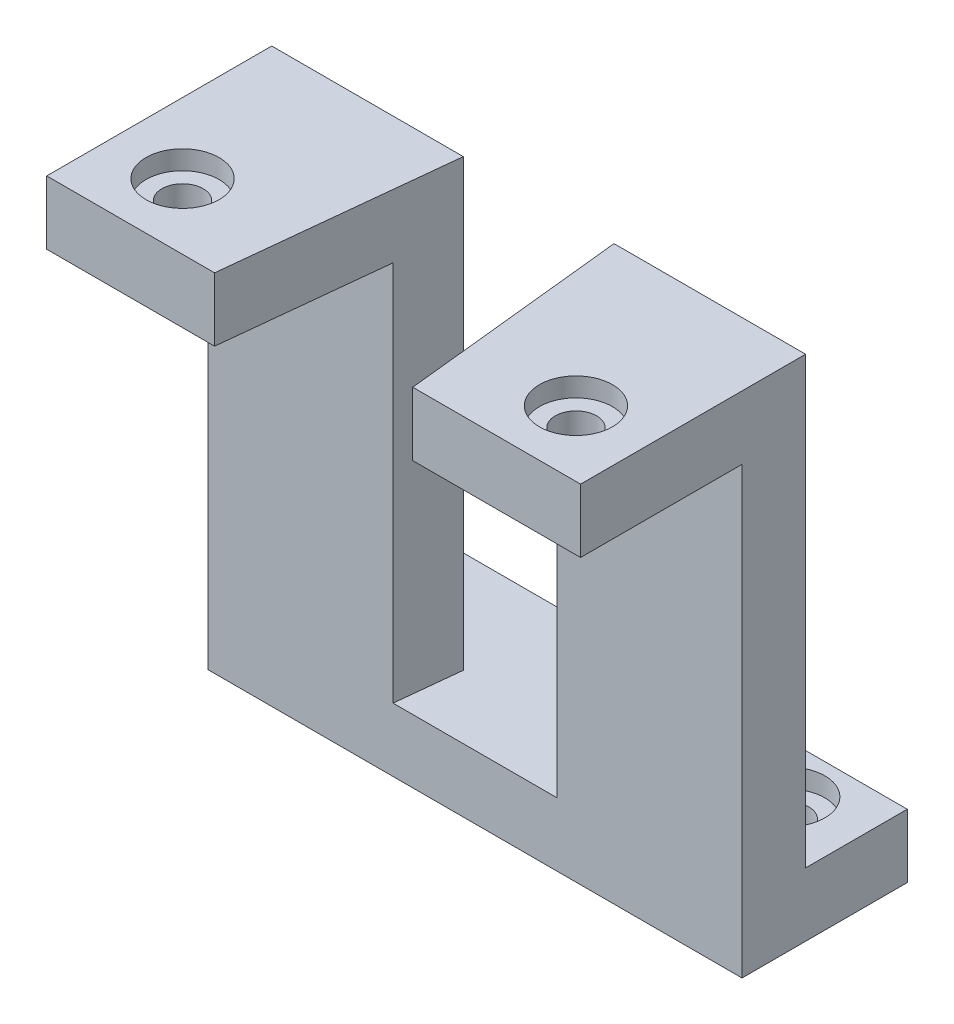
ISO-10303-21;
HEADER;
FILE_DESCRIPTION(('STEP AP214'),'2;1');
FILE_NAME('part.step','',(''),(''),'','','');
FILE_SCHEMA(('AUTOMOTIVE_DESIGN { 1 0 10303 214 1 1 1 1 }'));
ENDSEC;
DATA;
#1=APPLICATION_CONTEXT('core data for automotive mechanical design processes');
#2=APPLICATION_PROTOCOL_DEFINITION('international standard','automotive_design',2000,#1);
#3=PRODUCT_CONTEXT('',#1,'mechanical');
#4=PRODUCT('Part','Part','',(#3));
#5=PRODUCT_RELATED_PRODUCT_CATEGORY('part','',(#4));
#6=PRODUCT_DEFINITION_FORMATION('','',#4);
#7=PRODUCT_DEFINITION_CONTEXT('part definition',#1,'design');
#8=PRODUCT_DEFINITION('design','',#6,#7);
#9=PRODUCT_DEFINITION_SHAPE('','',#8);
#10=(LENGTH_UNIT() NAMED_UNIT(*) SI_UNIT(.MILLI.,.METRE.));
#11=(NAMED_UNIT(*) PLANE_ANGLE_UNIT() SI_UNIT($,.RADIAN.));
#12=(NAMED_UNIT(*) SI_UNIT($,.STERADIAN.) SOLID_ANGLE_UNIT());
#13=UNCERTAINTY_MEASURE_WITH_UNIT(LENGTH_MEASURE(1.E-05),#10,'distance_accuracy_value','');
#14=(GEOMETRIC_REPRESENTATION_CONTEXT(3) GLOBAL_UNCERTAINTY_ASSIGNED_CONTEXT((#13)) GLOBAL_UNIT_ASSIGNED_CONTEXT((#10,
#11,#12)) REPRESENTATION_CONTEXT('',''));
#15=CARTESIAN_POINT('',(0.,0.,0.));
#16=DIRECTION('',(0.,0.,1.));
#17=DIRECTION('',(1.,0.,0.));
#18=AXIS2_PLACEMENT_3D('',#15,#16,#17);
#19=CARTESIAN_POINT('',(-21.,10.,-12.7244387232156));
#20=DIRECTION('',(0.,0.,1.));
#21=DIRECTION('',(1.,0.,0.));
#22=AXIS2_PLACEMENT_3D('',#19,#20,#21);
#23=PLANE('',#22);
#24=DIRECTION('',(1.,0.,0.));
#25=VECTOR('',#24,1.);
#26=CARTESIAN_POINT('',(21.,-25.,-12.7244387232156));
#27=LINE('',#26,#25);
#28=CARTESIAN_POINT('',(5.92793817651512,-25.,-12.7244387232156));
#29=VERTEX_POINT('',#28);
#30=CARTESIAN_POINT('',(21.,-25.,-12.7244387232156));
#31=VERTEX_POINT('',#30);
#32=EDGE_CURVE('E153',#29,#31,#27,.T.);
#33=ORIENTED_EDGE('',*,*,#32,.F.);
#34=DIRECTION('',(0.,1.,0.));
#35=VECTOR('',#34,1.);
#36=CARTESIAN_POINT('',(5.92793817651512,-48.5884902828483,-12.7244387232156));
#37=LINE('',#36,#35);
#38=CARTESIAN_POINT('',(5.92793817651512,10.,-12.7244387232156));
#39=VERTEX_POINT('',#38);
#40=EDGE_CURVE('E159',#29,#39,#37,.T.);
#41=ORIENTED_EDGE('',*,*,#40,.T.);
#42=DIRECTION('',(-1.,0.,0.));
#43=VECTOR('',#42,1.);
#44=CARTESIAN_POINT('',(-21.,10.,-12.7244387232156));
#45=LINE('',#44,#43);
#46=CARTESIAN_POINT('',(21.,10.,-12.7244387232156));
#47=VERTEX_POINT('',#46);
#48=EDGE_CURVE('E233',#47,#39,#45,.T.);
#49=ORIENTED_EDGE('',*,*,#48,.F.);
#50=DIRECTION('',(0.,-1.,0.));
#51=VECTOR('',#50,1.);
#52=CARTESIAN_POINT('',(21.,10.,-12.7244387232156));
#53=LINE('',#52,#51);
#54=EDGE_CURVE('E173',#47,#31,#53,.T.);
#55=ORIENTED_EDGE('',*,*,#54,.T.);
#56=EDGE_LOOP('',(#33,#41,#49,#55));
#57=FACE_BOUND('',#56,.T.);
#58=ADVANCED_FACE('F45',(#57),#23,.F.);
#59=CARTESIAN_POINT('',(0.,10.,0.));
#60=DIRECTION('',(0.,1.,0.));
#61=DIRECTION('',(0.,0.,1.));
#62=AXIS2_PLACEMENT_3D('',#59,#60,#61);
#63=PLANE('',#62);
#64=DIRECTION('',(-0.104911561400397,0.,-0.994481555527568));
#65=VECTOR('',#64,1.);
#66=CARTESIAN_POINT('',(7.79534727241365,10.,4.97717469008432));
#67=LINE('',#66,#65);
#68=CARTESIAN_POINT('',(7.79534727241365,10.,4.97717469008432));
#69=VERTEX_POINT('',#68);
#70=EDGE_CURVE('E165',#69,#39,#67,.T.);
#71=ORIENTED_EDGE('',*,*,#70,.F.);
#72=DIRECTION('',(1.,0.,0.));
#73=VECTOR('',#72,1.);
#74=CARTESIAN_POINT('',(-21.,10.,4.97717469008432));
#75=LINE('',#74,#73);
#76=CARTESIAN_POINT('',(21.,10.,4.97717469008432));
#77=VERTEX_POINT('',#76);
#78=EDGE_CURVE('E239',#69,#77,#75,.T.);
#79=ORIENTED_EDGE('',*,*,#78,.T.);
#80=DIRECTION('',(0.,0.,-1.));
#81=VECTOR('',#80,1.);
#82=CARTESIAN_POINT('',(21.,10.,-4.97717469008432));
#83=LINE('',#82,#81);
#84=EDGE_CURVE('E228',#77,#47,#83,.T.);
#85=ORIENTED_EDGE('',*,*,#84,.T.);
#86=ORIENTED_EDGE('',*,*,#48,.T.);
#87=EDGE_LOOP('',(#71,#79,#85,#86));
#88=FACE_BOUND('',#87,.T.);
#89=CARTESIAN_POINT('',(15.475,10.,-0.182409543615654));
#90=DIRECTION('',(0.,1.,0.));
#91=DIRECTION('',(0.,0.,1.));
#92=AXIS2_PLACEMENT_3D('',#89,#90,#91);
#93=CIRCLE('',#92,2.875);
#94=CARTESIAN_POINT('',(15.475,10.,2.69259045638435));
#95=VERTEX_POINT('',#94);
#96=EDGE_CURVE('E221',#95,#95,#93,.T.);
#97=ORIENTED_EDGE('',*,*,#96,.F.);
#98=EDGE_LOOP('',(#97));
#99=FACE_BOUND('',#98,.T.);
#100=ADVANCED_FACE('F335',(#88,#99),#63,.T.);
#101=CARTESIAN_POINT('',(-21.,10.,4.97717469008432));
#102=DIRECTION('',(0.,0.,-1.));
#103=DIRECTION('',(-1.,0.,0.));
#104=AXIS2_PLACEMENT_3D('',#101,#102,#103);
#105=PLANE('',#104);
#106=ORIENTED_EDGE('',*,*,#78,.F.);
#107=DIRECTION('',(0.,1.,0.));
#108=VECTOR('',#107,1.);
#109=CARTESIAN_POINT('',(7.79534727241365,-48.5884902828483,4.97717469008432));
#110=LINE('',#109,#108);
#111=CARTESIAN_POINT('',(7.79534727241365,5.,4.97717469008432));
#112=VERTEX_POINT('',#111);
#113=EDGE_CURVE('E341',#112,#69,#110,.T.);
#114=ORIENTED_EDGE('',*,*,#113,.F.);
#115=DIRECTION('',(-1.,0.,0.));
#116=VECTOR('',#115,1.);
#117=CARTESIAN_POINT('',(21.001,5.,4.97717469008432));
#118=LINE('',#117,#116);
#119=CARTESIAN_POINT('',(21.,5.,4.97717469008432));
#120=VERTEX_POINT('',#119);
#121=EDGE_CURVE('E283',#120,#112,#118,.T.);
#122=ORIENTED_EDGE('',*,*,#121,.F.);
#123=DIRECTION('',(0.,-1.,0.));
#124=VECTOR('',#123,1.);
#125=CARTESIAN_POINT('',(21.,10.,4.97717469008432));
#126=LINE('',#125,#124);
#127=EDGE_CURVE('E244',#77,#120,#126,.T.);
#128=ORIENTED_EDGE('',*,*,#127,.F.);
#129=EDGE_LOOP('',(#106,#114,#122,#128));
#130=FACE_BOUND('',#129,.T.);
#131=ADVANCED_FACE('F340',(#130),#105,.F.);
#132=CARTESIAN_POINT('',(21.001,5.,-7.7244387232156));
#133=DIRECTION('',(0.,1.,0.));
#134=DIRECTION('',(0.,0.,1.));
#135=AXIS2_PLACEMENT_3D('',#132,#133,#134);
#136=PLANE('',#135);
#137=CARTESIAN_POINT('',(15.475,5.,-0.182409543615654));
#138=DIRECTION('',(0.,1.,0.));
#139=DIRECTION('',(0.,0.,1.));
#140=AXIS2_PLACEMENT_3D('',#137,#138,#139);
#141=CIRCLE('',#140,1.625);
#142=CARTESIAN_POINT('',(15.475,5.,1.44259045638435));
#143=VERTEX_POINT('',#142);
#144=EDGE_CURVE('E298',#143,#143,#141,.F.);
#145=ORIENTED_EDGE('',*,*,#144,.F.);
#146=EDGE_LOOP('',(#145));
#147=FACE_BOUND('',#146,.T.);
#148=ORIENTED_EDGE('',*,*,#121,.T.);
#149=DIRECTION('',(-0.104911561400397,0.,-0.994481555527568));
#150=VECTOR('',#149,1.);
#151=CARTESIAN_POINT('',(6.61550192638206,5.,-6.20685897924032));
#152=LINE('',#151,#150);
#153=CARTESIAN_POINT('',(6.4554067897703,5.,-7.7244387232156));
#154=VERTEX_POINT('',#153);
#155=EDGE_CURVE('E54',#112,#154,#152,.T.);
#156=ORIENTED_EDGE('',*,*,#155,.T.);
#157=DIRECTION('',(-1.,0.,0.));
#158=VECTOR('',#157,1.);
#159=CARTESIAN_POINT('',(21.001,5.,-7.7244387232156));
#160=LINE('',#159,#158);
#161=CARTESIAN_POINT('',(21.,5.,-7.7244387232156));
#162=VERTEX_POINT('',#161);
#163=EDGE_CURVE('E176',#162,#154,#160,.T.);
#164=ORIENTED_EDGE('',*,*,#163,.F.);
#165=DIRECTION('',(0.,0.,1.));
#166=VECTOR('',#165,1.);
#167=CARTESIAN_POINT('',(21.,5.,-7.7244387232156));
#168=LINE('',#167,#166);
#169=EDGE_CURVE('E294',#162,#120,#168,.T.);
#170=ORIENTED_EDGE('',*,*,#169,.T.);
#171=EDGE_LOOP('',(#148,#156,#164,#170));
#172=FACE_BOUND('',#171,.T.);
#173=ADVANCED_FACE('F280',(#147,#172),#136,.F.);
#174=CARTESIAN_POINT('',(15.475,-30.001,-16.8849666072387));
#175=DIRECTION('',(0.,1.,0.));
#176=DIRECTION('',(-1.,0.,0.));
#177=AXIS2_PLACEMENT_3D('',#174,#175,#176);
#178=CYLINDRICAL_SURFACE('',#177,1.625);
#179=CARTESIAN_POINT('',(15.475,-30.,-16.8849666072387));
#180=DIRECTION('',(0.,1.,0.));
#181=DIRECTION('',(0.,0.,1.));
#182=AXIS2_PLACEMENT_3D('',#179,#180,#181);
#183=CIRCLE('',#182,1.625);
#184=CARTESIAN_POINT('',(15.475,-30.,-15.2599666072387));
#185=VERTEX_POINT('',#184);
#186=EDGE_CURVE('E273',#185,#185,#183,.F.);
#187=ORIENTED_EDGE('',*,*,#186,.T.);
#188=EDGE_LOOP('',(#187));
#189=FACE_BOUND('',#188,.T.);
#190=CARTESIAN_POINT('',(15.475,-26.5,-16.8849666072387));
#191=DIRECTION('',(0.,1.,0.));
#192=DIRECTION('',(-1.,0.,0.));
#193=AXIS2_PLACEMENT_3D('',#190,#191,#192);
#194=CIRCLE('',#193,1.625);
#195=CARTESIAN_POINT('',(13.85,-26.5,-16.8849666072387));
#196=VERTEX_POINT('',#195);
#197=EDGE_CURVE('E268',#196,#196,#194,.F.);
#198=ORIENTED_EDGE('',*,*,#197,.F.);
#199=EDGE_LOOP('',(#198));
#200=FACE_BOUND('',#199,.T.);
#201=ADVANCED_FACE('F415',(#189,#200),#178,.F.);
#202=CARTESIAN_POINT('',(-15.475,-30.001,-16.8849666072387));
#203=DIRECTION('',(0.,1.,0.));
#204=DIRECTION('',(-1.,0.,0.));
#205=AXIS2_PLACEMENT_3D('',#202,#203,#204);
#206=CYLINDRICAL_SURFACE('',#205,1.625);
#207=CARTESIAN_POINT('',(-15.475,-30.,-16.8849666072387));
#208=DIRECTION('',(0.,1.,0.));
#209=DIRECTION('',(0.,0.,1.));
#210=AXIS2_PLACEMENT_3D('',#207,#208,#209);
#211=CIRCLE('',#210,1.625);
#212=CARTESIAN_POINT('',(-15.475,-30.,-15.2599666072387));
#213=VERTEX_POINT('',#212);
#214=EDGE_CURVE('E299',#213,#213,#211,.F.);
#215=ORIENTED_EDGE('',*,*,#214,.T.);
#216=EDGE_LOOP('',(#215));
#217=FACE_BOUND('',#216,.T.);
#218=CARTESIAN_POINT('',(-15.475,-26.5,-16.8849666072387));
#219=DIRECTION('',(0.,1.,0.));
#220=DIRECTION('',(-1.,0.,0.));
#221=AXIS2_PLACEMENT_3D('',#218,#219,#220);
#222=CIRCLE('',#221,1.625);
#223=CARTESIAN_POINT('',(-17.1,-26.5,-16.8849666072387));
#224=VERTEX_POINT('',#223);
#225=EDGE_CURVE('E264',#224,#224,#222,.F.);
#226=ORIENTED_EDGE('',*,*,#225,.F.);
#227=EDGE_LOOP('',(#226));
#228=FACE_BOUND('',#227,.T.);
#229=ADVANCED_FACE('F405',(#217,#228),#206,.F.);
#230=CARTESIAN_POINT('',(-5.92793817651512,10.,-12.7244387232156));
#231=VERTEX_POINT('',#230);
#232=CARTESIAN_POINT('',(-21.,10.,-12.7244387232156));
#233=VERTEX_POINT('',#232);
#234=EDGE_CURVE('E231',#231,#233,#45,.T.);
#235=ORIENTED_EDGE('',*,*,#234,.F.);
#236=DIRECTION('',(0.,1.,0.));
#237=VECTOR('',#236,1.);
#238=CARTESIAN_POINT('',(-5.92793817651512,-48.5884902828483,-12.7244387232156));
#239=LINE('',#238,#237);
#240=CARTESIAN_POINT('',(-5.92793817651512,-25.,-12.7244387232156));
#241=VERTEX_POINT('',#240);
#242=EDGE_CURVE('E170',#241,#231,#239,.T.);
#243=ORIENTED_EDGE('',*,*,#242,.F.);
#244=CARTESIAN_POINT('',(-21.,-25.,-12.7244387232156));
#245=VERTEX_POINT('',#244);
#246=EDGE_CURVE('E69',#245,#241,#27,.T.);
#247=ORIENTED_EDGE('',*,*,#246,.F.);
#248=DIRECTION('',(0.,-1.,0.));
#249=VECTOR('',#248,1.);
#250=CARTESIAN_POINT('',(-21.,10.,-12.7244387232156));
#251=LINE('',#250,#249);
#252=EDGE_CURVE('E252',#233,#245,#251,.T.);
#253=ORIENTED_EDGE('',*,*,#252,.F.);
#254=EDGE_LOOP('',(#235,#243,#247,#253));
#255=FACE_BOUND('',#254,.T.);
#256=ADVANCED_FACE('F396',(#255),#23,.F.);
#257=CARTESIAN_POINT('',(-15.475,10.,-0.182409543615654));
#258=DIRECTION('',(0.,-1.,0.));
#259=DIRECTION('',(0.,0.,-1.));
#260=AXIS2_PLACEMENT_3D('',#257,#258,#259);
#261=CYLINDRICAL_SURFACE('',#260,1.625);
#262=CARTESIAN_POINT('',(-15.475,5.,-0.182409543615654));
#263=DIRECTION('',(0.,1.,0.));
#264=DIRECTION('',(0.,0.,1.));
#265=AXIS2_PLACEMENT_3D('',#262,#263,#264);
#266=CIRCLE('',#265,1.625);
#267=CARTESIAN_POINT('',(-15.475,5.,1.44259045638435));
#268=VERTEX_POINT('',#267);
#269=EDGE_CURVE('E304',#268,#268,#266,.F.);
#270=ORIENTED_EDGE('',*,*,#269,.T.);
#271=EDGE_LOOP('',(#270));
#272=FACE_BOUND('',#271,.T.);
#273=CARTESIAN_POINT('',(-15.475,8.5,-0.182409543615654));
#274=DIRECTION('',(0.,1.,0.));
#275=DIRECTION('',(0.,0.,1.));
#276=AXIS2_PLACEMENT_3D('',#273,#274,#275);
#277=CIRCLE('',#276,1.625);
#278=CARTESIAN_POINT('',(-15.475,8.5,1.44259045638435));
#279=VERTEX_POINT('',#278);
#280=EDGE_CURVE('E232',#279,#279,#277,.T.);
#281=ORIENTED_EDGE('',*,*,#280,.T.);
#282=EDGE_LOOP('',(#281));
#283=FACE_BOUND('',#282,.T.);
#284=ADVANCED_FACE('F404',(#272,#283),#261,.F.);
#285=CARTESIAN_POINT('',(15.475,10.,-0.182409543615654));
#286=DIRECTION('',(0.,-1.,0.));
#287=DIRECTION('',(0.,0.,-1.));
#288=AXIS2_PLACEMENT_3D('',#285,#286,#287);
#289=CYLINDRICAL_SURFACE('',#288,1.625);
#290=ORIENTED_EDGE('',*,*,#144,.T.);
#291=EDGE_LOOP('',(#290));
#292=FACE_BOUND('',#291,.T.);
#293=CARTESIAN_POINT('',(15.475,8.5,-0.182409543615654));
#294=DIRECTION('',(0.,1.,0.));
#295=DIRECTION('',(0.,0.,1.));
#296=AXIS2_PLACEMENT_3D('',#293,#294,#295);
#297=CIRCLE('',#296,1.625);
#298=CARTESIAN_POINT('',(15.475,8.5,1.44259045638435));
#299=VERTEX_POINT('',#298);
#300=EDGE_CURVE('E216',#299,#299,#297,.T.);
#301=ORIENTED_EDGE('',*,*,#300,.T.);
#302=EDGE_LOOP('',(#301));
#303=FACE_BOUND('',#302,.T.);
#304=ADVANCED_FACE('F411',(#292,#303),#289,.F.);
#305=DIRECTION('',(-0.104911561400397,0.,0.994481555527568));
#306=VECTOR('',#305,1.);
#307=CARTESIAN_POINT('',(-7.79534727241365,10.,4.97717469008432));
#308=LINE('',#307,#306);
#309=CARTESIAN_POINT('',(-7.79534727241365,10.,4.97717469008432));
#310=VERTEX_POINT('',#309);
#311=EDGE_CURVE('E160',#231,#310,#308,.T.);
#312=ORIENTED_EDGE('',*,*,#311,.F.);
#313=ORIENTED_EDGE('',*,*,#234,.T.);
#314=DIRECTION('',(0.,0.,1.));
#315=VECTOR('',#314,1.);
#316=CARTESIAN_POINT('',(-21.,10.,-4.97717469008432));
#317=LINE('',#316,#315);
#318=CARTESIAN_POINT('',(-21.,10.,4.97717469008432));
#319=VERTEX_POINT('',#318);
#320=EDGE_CURVE('E236',#233,#319,#317,.T.);
#321=ORIENTED_EDGE('',*,*,#320,.T.);
#322=EDGE_CURVE('E240',#319,#310,#75,.T.);
#323=ORIENTED_EDGE('',*,*,#322,.T.);
#324=EDGE_LOOP('',(#312,#313,#321,#323));
#325=FACE_BOUND('',#324,.T.);
#326=CARTESIAN_POINT('',(-15.475,10.,-0.182409543615654));
#327=DIRECTION('',(0.,1.,0.));
#328=DIRECTION('',(0.,0.,1.));
#329=AXIS2_PLACEMENT_3D('',#326,#327,#328);
#330=CIRCLE('',#329,2.875);
#331=CARTESIAN_POINT('',(-15.475,10.,2.69259045638435));
#332=VERTEX_POINT('',#331);
#333=EDGE_CURVE('E217',#332,#332,#330,.T.);
#334=ORIENTED_EDGE('',*,*,#333,.F.);
#335=EDGE_LOOP('',(#334));
#336=FACE_BOUND('',#335,.T.);
#337=ADVANCED_FACE('F401',(#325,#336),#63,.T.);
#338=CARTESIAN_POINT('',(21.,10.,-12.7244387232156));
#339=DIRECTION('',(-1.,0.,0.));
#340=DIRECTION('',(0.,0.,1.));
#341=AXIS2_PLACEMENT_3D('',#338,#339,#340);
#342=PLANE('',#341);
#343=ORIENTED_EDGE('',*,*,#169,.F.);
#344=DIRECTION('',(0.,1.,0.));
#345=VECTOR('',#344,1.);
#346=CARTESIAN_POINT('',(21.,-30.,-7.7244387232156));
#347=LINE('',#346,#345);
#348=CARTESIAN_POINT('',(21.,-30.,-7.7244387232156));
#349=VERTEX_POINT('',#348);
#350=EDGE_CURVE('E208',#349,#162,#347,.T.);
#351=ORIENTED_EDGE('',*,*,#350,.F.);
#352=DIRECTION('',(0.,0.,1.));
#353=VECTOR('',#352,1.);
#354=CARTESIAN_POINT('',(21.,-30.,-12.7244387232156));
#355=LINE('',#354,#353);
#356=CARTESIAN_POINT('',(21.,-30.,-20.7244387232156));
#357=VERTEX_POINT('',#356);
#358=EDGE_CURVE('E198',#357,#349,#355,.T.);
#359=ORIENTED_EDGE('',*,*,#358,.F.);
#360=DIRECTION('',(0.,-1.,0.));
#361=VECTOR('',#360,1.);
#362=CARTESIAN_POINT('',(21.,-30.,-20.7244387232156));
#363=LINE('',#362,#361);
#364=CARTESIAN_POINT('',(21.,-25.,-20.7244387232156));
#365=VERTEX_POINT('',#364);
#366=EDGE_CURVE('E180',#365,#357,#363,.T.);
#367=ORIENTED_EDGE('',*,*,#366,.F.);
#368=DIRECTION('',(0.,0.,1.));
#369=VECTOR('',#368,1.);
#370=CARTESIAN_POINT('',(21.,-25.,-20.7244387232156));
#371=LINE('',#370,#369);
#372=EDGE_CURVE('E188',#365,#31,#371,.T.);
#373=ORIENTED_EDGE('',*,*,#372,.T.);
#374=ORIENTED_EDGE('',*,*,#54,.F.);
#375=ORIENTED_EDGE('',*,*,#84,.F.);
#376=ORIENTED_EDGE('',*,*,#127,.T.);
#377=EDGE_LOOP('',(#343,#351,#359,#367,#373,#374,#375,#376));
#378=FACE_BOUND('',#377,.T.);
#379=ADVANCED_FACE('F47',(#378),#342,.F.);
#380=CARTESIAN_POINT('',(-21.,10.,-4.97717469008432));
#381=DIRECTION('',(1.,0.,0.));
#382=DIRECTION('',(0.,0.,-1.));
#383=AXIS2_PLACEMENT_3D('',#380,#381,#382);
#384=PLANE('',#383);
#385=DIRECTION('',(0.,1.,0.));
#386=VECTOR('',#385,1.);
#387=CARTESIAN_POINT('',(-21.,-30.,-7.7244387232156));
#388=LINE('',#387,#386);
#389=CARTESIAN_POINT('',(-21.,-30.,-7.7244387232156));
#390=VERTEX_POINT('',#389);
#391=CARTESIAN_POINT('',(-21.,5.,-7.7244387232156));
#392=VERTEX_POINT('',#391);
#393=EDGE_CURVE('E204',#390,#392,#388,.T.);
#394=ORIENTED_EDGE('',*,*,#393,.T.);
#395=DIRECTION('',(0.,0.,-1.));
#396=VECTOR('',#395,1.);
#397=CARTESIAN_POINT('',(-21.,5.,-7.7244387232156));
#398=LINE('',#397,#396);
#399=CARTESIAN_POINT('',(-21.,5.,4.97717469008432));
#400=VERTEX_POINT('',#399);
#401=EDGE_CURVE('E313',#400,#392,#398,.T.);
#402=ORIENTED_EDGE('',*,*,#401,.F.);
#403=DIRECTION('',(0.,-1.,0.));
#404=VECTOR('',#403,1.);
#405=CARTESIAN_POINT('',(-21.,10.,4.97717469008432));
#406=LINE('',#405,#404);
#407=EDGE_CURVE('E248',#319,#400,#406,.T.);
#408=ORIENTED_EDGE('',*,*,#407,.F.);
#409=ORIENTED_EDGE('',*,*,#320,.F.);
#410=ORIENTED_EDGE('',*,*,#252,.T.);
#411=DIRECTION('',(0.,0.,1.));
#412=VECTOR('',#411,1.);
#413=CARTESIAN_POINT('',(-21.,-25.,-20.7244387232156));
#414=LINE('',#413,#412);
#415=CARTESIAN_POINT('',(-21.,-25.,-20.7244387232156));
#416=VERTEX_POINT('',#415);
#417=EDGE_CURVE('E191',#416,#245,#414,.T.);
#418=ORIENTED_EDGE('',*,*,#417,.F.);
#419=DIRECTION('',(0.,1.,0.));
#420=VECTOR('',#419,1.);
#421=CARTESIAN_POINT('',(-21.,-30.,-20.7244387232156));
#422=LINE('',#421,#420);
#423=CARTESIAN_POINT('',(-21.,-30.,-20.7244387232156));
#424=VERTEX_POINT('',#423);
#425=EDGE_CURVE('E326',#424,#416,#422,.T.);
#426=ORIENTED_EDGE('',*,*,#425,.F.);
#427=DIRECTION('',(0.,0.,-1.));
#428=VECTOR('',#427,1.);
#429=CARTESIAN_POINT('',(-21.,-30.,-12.7244387232156));
#430=LINE('',#429,#428);
#431=EDGE_CURVE('E195',#390,#424,#430,.T.);
#432=ORIENTED_EDGE('',*,*,#431,.F.);
#433=EDGE_LOOP('',(#394,#402,#408,#409,#410,#418,#426,#432));
#434=FACE_BOUND('',#433,.T.);
#435=ADVANCED_FACE('F442',(#434),#384,.F.);
#436=CARTESIAN_POINT('',(-7.79534727241365,5.,4.97717469008432));
#437=VERTEX_POINT('',#436);
#438=EDGE_CURVE('E316',#437,#400,#118,.T.);
#439=ORIENTED_EDGE('',*,*,#438,.F.);
#440=DIRECTION('',(0.,1.,0.));
#441=VECTOR('',#440,1.);
#442=CARTESIAN_POINT('',(-7.79534727241365,-48.5884902828483,4.97717469008432));
#443=LINE('',#442,#441);
#444=EDGE_CURVE('E61',#437,#310,#443,.T.);
#445=ORIENTED_EDGE('',*,*,#444,.T.);
#446=ORIENTED_EDGE('',*,*,#322,.F.);
#447=ORIENTED_EDGE('',*,*,#407,.T.);
#448=EDGE_LOOP('',(#439,#445,#446,#447));
#449=FACE_BOUND('',#448,.T.);
#450=ADVANCED_FACE('F444',(#449),#105,.F.);
#451=CARTESIAN_POINT('',(15.475,8.5,-0.182409543615654));
#452=DIRECTION('',(0.,1.,0.));
#453=DIRECTION('',(0.,0.,1.));
#454=AXIS2_PLACEMENT_3D('',#451,#452,#453);
#455=CYLINDRICAL_SURFACE('',#454,2.875);
#456=CARTESIAN_POINT('',(15.475,8.5,-0.182409543615654));
#457=DIRECTION('',(0.,1.,0.));
#458=DIRECTION('',(0.,0.,1.));
#459=AXIS2_PLACEMENT_3D('',#456,#457,#458);
#460=CIRCLE('',#459,2.875);
#461=CARTESIAN_POINT('',(15.475,8.5,2.69259045638435));
#462=VERTEX_POINT('',#461);
#463=EDGE_CURVE('E211',#462,#462,#460,.T.);
#464=ORIENTED_EDGE('',*,*,#463,.F.);
#465=EDGE_LOOP('',(#464));
#466=FACE_BOUND('',#465,.T.);
#467=ORIENTED_EDGE('',*,*,#96,.T.);
#468=EDGE_LOOP('',(#467));
#469=FACE_BOUND('',#468,.T.);
#470=ADVANCED_FACE('F446',(#466,#469),#455,.F.);
#471=CARTESIAN_POINT('',(15.475,8.5,-0.182409543615654));
#472=DIRECTION('',(0.,1.,0.));
#473=DIRECTION('',(0.,0.,1.));
#474=AXIS2_PLACEMENT_3D('',#471,#472,#473);
#475=PLANE('',#474);
#476=ORIENTED_EDGE('',*,*,#300,.F.);
#477=EDGE_LOOP('',(#476));
#478=FACE_BOUND('',#477,.T.);
#479=ORIENTED_EDGE('',*,*,#463,.T.);
#480=EDGE_LOOP('',(#479));
#481=FACE_BOUND('',#480,.T.);
#482=ADVANCED_FACE('F451',(#478,#481),#475,.T.);
#483=CARTESIAN_POINT('',(-15.475,8.5,-0.182409543615654));
#484=DIRECTION('',(0.,1.,0.));
#485=DIRECTION('',(0.,0.,1.));
#486=AXIS2_PLACEMENT_3D('',#483,#484,#485);
#487=CYLINDRICAL_SURFACE('',#486,2.875);
#488=CARTESIAN_POINT('',(-15.475,8.5,-0.182409543615654));
#489=DIRECTION('',(0.,1.,0.));
#490=DIRECTION('',(0.,0.,1.));
#491=AXIS2_PLACEMENT_3D('',#488,#489,#490);
#492=CIRCLE('',#491,2.875);
#493=CARTESIAN_POINT('',(-15.475,8.5,2.69259045638435));
#494=VERTEX_POINT('',#493);
#495=EDGE_CURVE('E212',#494,#494,#492,.T.);
#496=ORIENTED_EDGE('',*,*,#495,.F.);
#497=EDGE_LOOP('',(#496));
#498=FACE_BOUND('',#497,.T.);
#499=ORIENTED_EDGE('',*,*,#333,.T.);
#500=EDGE_LOOP('',(#499));
#501=FACE_BOUND('',#500,.T.);
#502=ADVANCED_FACE('F482',(#498,#501),#487,.F.);
#503=CARTESIAN_POINT('',(-15.475,8.5,-0.182409543615654));
#504=DIRECTION('',(0.,1.,0.));
#505=DIRECTION('',(0.,0.,1.));
#506=AXIS2_PLACEMENT_3D('',#503,#504,#505);
#507=PLANE('',#506);
#508=ORIENTED_EDGE('',*,*,#280,.F.);
#509=EDGE_LOOP('',(#508));
#510=FACE_BOUND('',#509,.T.);
#511=ORIENTED_EDGE('',*,*,#495,.T.);
#512=EDGE_LOOP('',(#511));
#513=FACE_BOUND('',#512,.T.);
#514=ADVANCED_FACE('F479',(#510,#513),#507,.T.);
#515=CARTESIAN_POINT('',(-21.,-30.,-7.7244387232156));
#516=DIRECTION('',(0.,0.,-1.));
#517=DIRECTION('',(-1.,0.,0.));
#518=AXIS2_PLACEMENT_3D('',#515,#516,#517);
#519=PLANE('',#518);
#520=ORIENTED_EDGE('',*,*,#163,.T.);
#521=DIRECTION('',(0.,-1.,0.));
#522=VECTOR('',#521,1.);
#523=CARTESIAN_POINT('',(6.45540678977029,-30.,-7.7244387232156));
#524=LINE('',#523,#522);
#525=CARTESIAN_POINT('',(6.4554067897703,-25.,-7.7244387232156));
#526=VERTEX_POINT('',#525);
#527=EDGE_CURVE('E287',#154,#526,#524,.T.);
#528=ORIENTED_EDGE('',*,*,#527,.T.);
#529=DIRECTION('',(-1.,0.,0.));
#530=VECTOR('',#529,1.);
#531=CARTESIAN_POINT('',(-21.,-25.,-7.7244387232156));
#532=LINE('',#531,#530);
#533=CARTESIAN_POINT('',(-6.4554067897703,-25.,-7.7244387232156));
#534=VERTEX_POINT('',#533);
#535=EDGE_CURVE('E11',#526,#534,#532,.T.);
#536=ORIENTED_EDGE('',*,*,#535,.T.);
#537=DIRECTION('',(0.,1.,0.));
#538=VECTOR('',#537,1.);
#539=CARTESIAN_POINT('',(-6.4554067897703,-30.,-7.7244387232156));
#540=LINE('',#539,#538);
#541=CARTESIAN_POINT('',(-6.4554067897703,5.,-7.7244387232156));
#542=VERTEX_POINT('',#541);
#543=EDGE_CURVE('E343',#534,#542,#540,.T.);
#544=ORIENTED_EDGE('',*,*,#543,.T.);
#545=EDGE_CURVE('E182',#542,#392,#160,.T.);
#546=ORIENTED_EDGE('',*,*,#545,.T.);
#547=ORIENTED_EDGE('',*,*,#393,.F.);
#548=DIRECTION('',(-1.,0.,0.));
#549=VECTOR('',#548,1.);
#550=CARTESIAN_POINT('',(-21.,-30.,-7.7244387232156));
#551=LINE('',#550,#549);
#552=EDGE_CURVE('E201',#349,#390,#551,.T.);
#553=ORIENTED_EDGE('',*,*,#552,.F.);
#554=ORIENTED_EDGE('',*,*,#350,.T.);
#555=EDGE_LOOP('',(#520,#528,#536,#544,#546,#547,#553,#554));
#556=FACE_BOUND('',#555,.T.);
#557=ADVANCED_FACE('F286',(#556),#519,.F.);
#558=CARTESIAN_POINT('',(0.,-30.,0.));
#559=DIRECTION('',(0.,1.,0.));
#560=DIRECTION('',(0.,0.,1.));
#561=AXIS2_PLACEMENT_3D('',#558,#559,#560);
#562=PLANE('',#561);
#563=ORIENTED_EDGE('',*,*,#214,.F.);
#564=EDGE_LOOP('',(#563));
#565=FACE_BOUND('',#564,.T.);
#566=ORIENTED_EDGE('',*,*,#186,.F.);
#567=EDGE_LOOP('',(#566));
#568=FACE_BOUND('',#567,.T.);
#569=ORIENTED_EDGE('',*,*,#431,.T.);
#570=DIRECTION('',(-1.,0.,0.));
#571=VECTOR('',#570,1.);
#572=CARTESIAN_POINT('',(21.,-30.,-20.7244387232156));
#573=LINE('',#572,#571);
#574=EDGE_CURVE('E323',#357,#424,#573,.T.);
#575=ORIENTED_EDGE('',*,*,#574,.F.);
#576=ORIENTED_EDGE('',*,*,#358,.T.);
#577=ORIENTED_EDGE('',*,*,#552,.T.);
#578=EDGE_LOOP('',(#569,#575,#576,#577));
#579=FACE_BOUND('',#578,.T.);
#580=ADVANCED_FACE('F381',(#565,#568,#579),#562,.F.);
#581=CARTESIAN_POINT('',(21.,-25.,-20.7244387232156));
#582=DIRECTION('',(0.,-1.,0.));
#583=DIRECTION('',(1.,0.,0.));
#584=AXIS2_PLACEMENT_3D('',#581,#582,#583);
#585=PLANE('',#584);
#586=CARTESIAN_POINT('',(-15.475,-25.,-16.8849666072387));
#587=DIRECTION('',(0.,1.,0.));
#588=DIRECTION('',(-1.,0.,0.));
#589=AXIS2_PLACEMENT_3D('',#586,#587,#588);
#590=CIRCLE('',#589,2.875);
#591=CARTESIAN_POINT('',(-18.35,-25.,-16.8849666072387));
#592=VERTEX_POINT('',#591);
#593=EDGE_CURVE('E359',#592,#592,#590,.T.);
#594=ORIENTED_EDGE('',*,*,#593,.F.);
#595=EDGE_LOOP('',(#594));
#596=FACE_BOUND('',#595,.T.);
#597=CARTESIAN_POINT('',(15.475,-25.,-16.8849666072387));
#598=DIRECTION('',(0.,1.,0.));
#599=DIRECTION('',(-1.,0.,0.));
#600=AXIS2_PLACEMENT_3D('',#597,#598,#599);
#601=CIRCLE('',#600,2.875);
#602=CARTESIAN_POINT('',(12.6,-25.,-16.8849666072387));
#603=VERTEX_POINT('',#602);
#604=EDGE_CURVE('E363',#603,#603,#601,.T.);
#605=ORIENTED_EDGE('',*,*,#604,.F.);
#606=EDGE_LOOP('',(#605));
#607=FACE_BOUND('',#606,.T.);
#608=ORIENTED_EDGE('',*,*,#246,.T.);
#609=DIRECTION('',(-0.104911561400397,0.,0.994481555527568));
#610=VECTOR('',#609,1.);
#611=CARTESIAN_POINT('',(-7.79534727241365,-25.,4.97717469008432));
#612=LINE('',#611,#610);
#613=EDGE_CURVE('E349',#241,#534,#612,.T.);
#614=ORIENTED_EDGE('',*,*,#613,.T.);
#615=ORIENTED_EDGE('',*,*,#535,.F.);
#616=DIRECTION('',(-0.104911561400397,0.,-0.994481555527568));
#617=VECTOR('',#616,1.);
#618=CARTESIAN_POINT('',(7.79534727241365,-25.,4.97717469008432));
#619=LINE('',#618,#617);
#620=EDGE_CURVE('E148',#526,#29,#619,.T.);
#621=ORIENTED_EDGE('',*,*,#620,.T.);
#622=ORIENTED_EDGE('',*,*,#32,.T.);
#623=ORIENTED_EDGE('',*,*,#372,.F.);
#624=DIRECTION('',(1.,0.,0.));
#625=VECTOR('',#624,1.);
#626=CARTESIAN_POINT('',(21.,-25.,-20.7244387232156));
#627=LINE('',#626,#625);
#628=EDGE_CURVE('E186',#416,#365,#627,.T.);
#629=ORIENTED_EDGE('',*,*,#628,.F.);
#630=ORIENTED_EDGE('',*,*,#417,.T.);
#631=EDGE_LOOP('',(#608,#614,#615,#621,#622,#623,#629,#630));
#632=FACE_BOUND('',#631,.T.);
#633=ADVANCED_FACE('F150',(#596,#607,#632),#585,.F.);
#634=CARTESIAN_POINT('',(0.,0.,-20.7244387232156));
#635=DIRECTION('',(0.,0.,1.));
#636=DIRECTION('',(1.,0.,0.));
#637=AXIS2_PLACEMENT_3D('',#634,#635,#636);
#638=PLANE('',#637);
#639=ORIENTED_EDGE('',*,*,#366,.T.);
#640=ORIENTED_EDGE('',*,*,#574,.T.);
#641=ORIENTED_EDGE('',*,*,#425,.T.);
#642=ORIENTED_EDGE('',*,*,#628,.T.);
#643=EDGE_LOOP('',(#639,#640,#641,#642));
#644=FACE_BOUND('',#643,.T.);
#645=ADVANCED_FACE('F333',(#644),#638,.F.);
#646=ORIENTED_EDGE('',*,*,#269,.F.);
#647=EDGE_LOOP('',(#646));
#648=FACE_BOUND('',#647,.T.);
#649=ORIENTED_EDGE('',*,*,#545,.F.);
#650=DIRECTION('',(-0.104911561400397,0.,0.994481555527568));
#651=VECTOR('',#650,1.);
#652=CARTESIAN_POINT('',(-6.15320961346092,5.,-10.5890373809862));
#653=LINE('',#652,#651);
#654=EDGE_CURVE('E257',#542,#437,#653,.T.);
#655=ORIENTED_EDGE('',*,*,#654,.T.);
#656=ORIENTED_EDGE('',*,*,#438,.T.);
#657=ORIENTED_EDGE('',*,*,#401,.T.);
#658=EDGE_LOOP('',(#649,#655,#656,#657));
#659=FACE_BOUND('',#658,.T.);
#660=ADVANCED_FACE('F389',(#648,#659),#136,.F.);
#661=CARTESIAN_POINT('',(-15.475,-26.5,-16.8849666072387));
#662=DIRECTION('',(0.,1.,0.));
#663=DIRECTION('',(-1.,0.,0.));
#664=AXIS2_PLACEMENT_3D('',#661,#662,#663);
#665=PLANE('',#664);
#666=CARTESIAN_POINT('',(-15.475,-26.5,-16.8849666072387));
#667=DIRECTION('',(0.,1.,0.));
#668=DIRECTION('',(-1.,0.,0.));
#669=AXIS2_PLACEMENT_3D('',#666,#667,#668);
#670=CIRCLE('',#669,2.875);
#671=CARTESIAN_POINT('',(-18.35,-26.5,-16.8849666072387));
#672=VERTEX_POINT('',#671);
#673=EDGE_CURVE('E269',#672,#672,#670,.T.);
#674=ORIENTED_EDGE('',*,*,#673,.T.);
#675=EDGE_LOOP('',(#674));
#676=FACE_BOUND('',#675,.T.);
#677=ORIENTED_EDGE('',*,*,#225,.T.);
#678=EDGE_LOOP('',(#677));
#679=FACE_BOUND('',#678,.T.);
#680=ADVANCED_FACE('F466',(#676,#679),#665,.T.);
#681=CARTESIAN_POINT('',(-15.475,-26.5,-16.8849666072387));
#682=DIRECTION('',(0.,1.,0.));
#683=DIRECTION('',(-1.,0.,0.));
#684=AXIS2_PLACEMENT_3D('',#681,#682,#683);
#685=CYLINDRICAL_SURFACE('',#684,2.875);
#686=ORIENTED_EDGE('',*,*,#673,.F.);
#687=EDGE_LOOP('',(#686));
#688=FACE_BOUND('',#687,.T.);
#689=ORIENTED_EDGE('',*,*,#593,.T.);
#690=EDGE_LOOP('',(#689));
#691=FACE_BOUND('',#690,.T.);
#692=ADVANCED_FACE('F472',(#688,#691),#685,.F.);
#693=CARTESIAN_POINT('',(15.475,-26.5,-16.8849666072387));
#694=DIRECTION('',(0.,1.,0.));
#695=DIRECTION('',(-1.,0.,0.));
#696=AXIS2_PLACEMENT_3D('',#693,#694,#695);
#697=PLANE('',#696);
#698=CARTESIAN_POINT('',(15.475,-26.5,-16.8849666072387));
#699=DIRECTION('',(0.,1.,0.));
#700=DIRECTION('',(-1.,0.,0.));
#701=AXIS2_PLACEMENT_3D('',#698,#699,#700);
#702=CIRCLE('',#701,2.875);
#703=CARTESIAN_POINT('',(12.6,-26.5,-16.8849666072387));
#704=VERTEX_POINT('',#703);
#705=EDGE_CURVE('E355',#704,#704,#702,.T.);
#706=ORIENTED_EDGE('',*,*,#705,.T.);
#707=EDGE_LOOP('',(#706));
#708=FACE_BOUND('',#707,.T.);
#709=ORIENTED_EDGE('',*,*,#197,.T.);
#710=EDGE_LOOP('',(#709));
#711=FACE_BOUND('',#710,.T.);
#712=ADVANCED_FACE('F371',(#708,#711),#697,.T.);
#713=CARTESIAN_POINT('',(15.475,-26.5,-16.8849666072387));
#714=DIRECTION('',(0.,1.,0.));
#715=DIRECTION('',(-1.,0.,0.));
#716=AXIS2_PLACEMENT_3D('',#713,#714,#715);
#717=CYLINDRICAL_SURFACE('',#716,2.875);
#718=ORIENTED_EDGE('',*,*,#705,.F.);
#719=EDGE_LOOP('',(#718));
#720=FACE_BOUND('',#719,.T.);
#721=ORIENTED_EDGE('',*,*,#604,.T.);
#722=EDGE_LOOP('',(#721));
#723=FACE_BOUND('',#722,.T.);
#724=ADVANCED_FACE('F374',(#720,#723),#717,.F.);
#725=CARTESIAN_POINT('',(7.79534727241365,-48.5884902828483,4.97717469008432));
#726=DIRECTION('',(0.994481555527568,0.,-0.104911561400397));
#727=DIRECTION('',(-0.104911561400397,0.,-0.994481555527568));
#728=AXIS2_PLACEMENT_3D('',#725,#726,#727);
#729=PLANE('',#728);
#730=ORIENTED_EDGE('',*,*,#155,.F.);
#731=ORIENTED_EDGE('',*,*,#113,.T.);
#732=ORIENTED_EDGE('',*,*,#70,.T.);
#733=ORIENTED_EDGE('',*,*,#40,.F.);
#734=ORIENTED_EDGE('',*,*,#620,.F.);
#735=ORIENTED_EDGE('',*,*,#527,.F.);
#736=EDGE_LOOP('',(#730,#731,#732,#733,#734,#735));
#737=FACE_BOUND('',#736,.T.);
#738=ADVANCED_FACE('F163',(#737),#729,.F.);
#739=CARTESIAN_POINT('',(-7.79534727241365,-48.5884902828483,4.97717469008432));
#740=DIRECTION('',(-0.994481555527568,0.,-0.104911561400397));
#741=DIRECTION('',(-0.104911561400397,0.,0.994481555527568));
#742=AXIS2_PLACEMENT_3D('',#739,#740,#741);
#743=PLANE('',#742);
#744=ORIENTED_EDGE('',*,*,#613,.F.);
#745=ORIENTED_EDGE('',*,*,#242,.T.);
#746=ORIENTED_EDGE('',*,*,#311,.T.);
#747=ORIENTED_EDGE('',*,*,#444,.F.);
#748=ORIENTED_EDGE('',*,*,#654,.F.);
#749=ORIENTED_EDGE('',*,*,#543,.F.);
#750=EDGE_LOOP('',(#744,#745,#746,#747,#748,#749));
#751=FACE_BOUND('',#750,.T.);
#752=ADVANCED_FACE('F433',(#751),#743,.F.);
#753=CLOSED_SHELL('',(#58,#100,#131,#173,#201,#229,#256,#284,#304,#337,#379,#435,#450,#470,#482,
#502,#514,#557,#580,#633,#645,#660,#680,#692,#712,#724,#738,#752));
#754=MANIFOLD_SOLID_BREP('B2',#753);
#755=ADVANCED_BREP_SHAPE_REPRESENTATION('',(#18,#754),#14);
#756=SHAPE_DEFINITION_REPRESENTATION(#9,#755);
ENDSEC;
END-ISO-10303-21;
